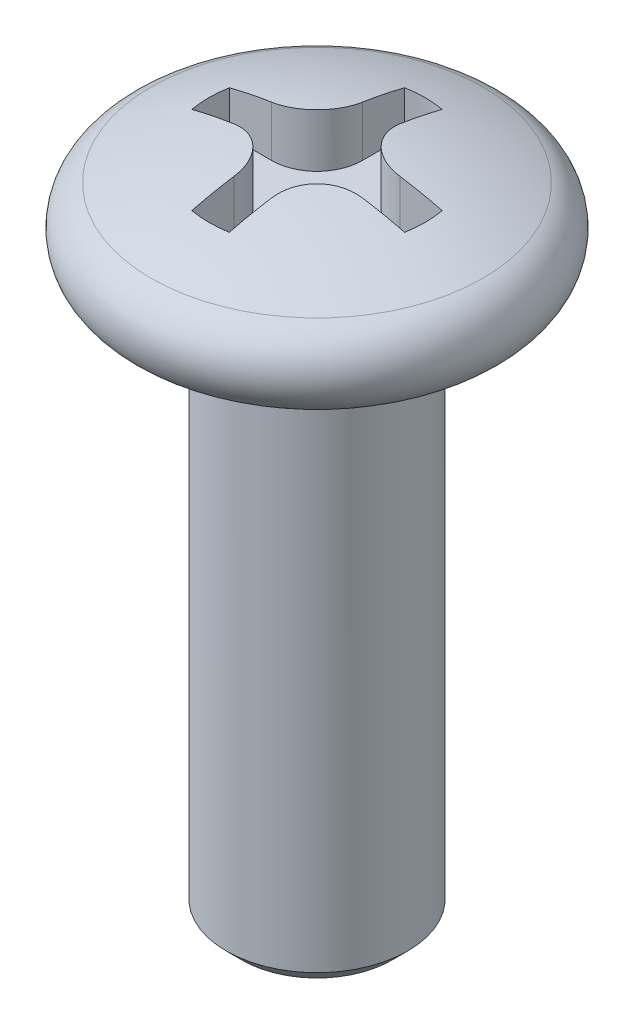
ISO-10303-21;
HEADER;
FILE_DESCRIPTION(('STEP AP214'),'2;1');
FILE_NAME('part.step','',(''),(''),'','','');
FILE_SCHEMA(('AUTOMOTIVE_DESIGN { 1 0 10303 214 1 1 1 1 }'));
ENDSEC;
DATA;
#1=APPLICATION_CONTEXT('core data for automotive mechanical design processes');
#2=APPLICATION_PROTOCOL_DEFINITION('international standard','automotive_design',2000,#1);
#3=PRODUCT_CONTEXT('',#1,'mechanical');
#4=PRODUCT('Part','Part','',(#3));
#5=PRODUCT_RELATED_PRODUCT_CATEGORY('part','',(#4));
#6=PRODUCT_DEFINITION_FORMATION('','',#4);
#7=PRODUCT_DEFINITION_CONTEXT('part definition',#1,'design');
#8=PRODUCT_DEFINITION('design','',#6,#7);
#9=PRODUCT_DEFINITION_SHAPE('','',#8);
#10=(LENGTH_UNIT() NAMED_UNIT(*) SI_UNIT(.MILLI.,.METRE.));
#11=(NAMED_UNIT(*) PLANE_ANGLE_UNIT() SI_UNIT($,.RADIAN.));
#12=(NAMED_UNIT(*) SI_UNIT($,.STERADIAN.) SOLID_ANGLE_UNIT());
#13=UNCERTAINTY_MEASURE_WITH_UNIT(LENGTH_MEASURE(1.E-05),#10,'distance_accuracy_value','');
#14=(GEOMETRIC_REPRESENTATION_CONTEXT(3) GLOBAL_UNCERTAINTY_ASSIGNED_CONTEXT((#13)) GLOBAL_UNIT_ASSIGNED_CONTEXT((#10,
#11,#12)) REPRESENTATION_CONTEXT('',''));
#15=CARTESIAN_POINT('',(0.,0.,0.));
#16=DIRECTION('',(0.,0.,1.));
#17=DIRECTION('',(1.,0.,0.));
#18=AXIS2_PLACEMENT_3D('',#15,#16,#17);
#19=CARTESIAN_POINT('',(0.,0.8,0.));
#20=DIRECTION('',(0.,-1.,0.));
#21=DIRECTION('',(0.,0.,-1.));
#22=AXIS2_PLACEMENT_3D('',#19,#20,#21);
#23=PLANE('',#22);
#24=DIRECTION('',(0.,0.,1.));
#25=VECTOR('',#24,1.);
#26=CARTESIAN_POINT('',(-0.2692388155425,0.8,1.526437178598));
#27=LINE('',#26,#25);
#28=CARTESIAN_POINT('',(-0.2692388155425,0.8,0.9192388155425));
#29=VERTEX_POINT('',#28);
#30=CARTESIAN_POINT('',(-0.2692388155425,0.8,1.52643717859784));
#31=VERTEX_POINT('',#30);
#32=EDGE_CURVE('E223',#29,#31,#27,.T.);
#33=ORIENTED_EDGE('',*,*,#32,.T.);
#34=CARTESIAN_POINT('',(0.,0.8,0.));
#35=DIRECTION('',(0.,-1.,0.));
#36=DIRECTION('',(0.,0.,-1.));
#37=AXIS2_PLACEMENT_3D('',#34,#35,#36);
#38=CIRCLE('',#37,1.55);
#39=CARTESIAN_POINT('',(0.269238815542473,0.8,1.52643717859769));
#40=VERTEX_POINT('',#39);
#41=EDGE_CURVE('E257',#31,#40,#38,.F.);
#42=ORIENTED_EDGE('',*,*,#41,.T.);
#43=DIRECTION('',(0.,0.,-1.));
#44=VECTOR('',#43,1.);
#45=CARTESIAN_POINT('',(0.2692388155425,0.8,0.9192388155425));
#46=LINE('',#45,#44);
#47=CARTESIAN_POINT('',(0.2692388155425,0.8,0.9192388155425));
#48=VERTEX_POINT('',#47);
#49=EDGE_CURVE('E217',#40,#48,#46,.T.);
#50=ORIENTED_EDGE('',*,*,#49,.T.);
#51=CARTESIAN_POINT('',(0.9192388155425,0.8,0.9192388155425));
#52=DIRECTION('',(0.,-1.,0.));
#53=DIRECTION('',(0.,0.,-1.));
#54=AXIS2_PLACEMENT_3D('',#51,#52,#53);
#55=CIRCLE('',#54,0.65);
#56=CARTESIAN_POINT('',(0.9192388155425,0.8,0.2692388155425));
#57=VERTEX_POINT('',#56);
#58=EDGE_CURVE('E222',#57,#48,#55,.F.);
#59=ORIENTED_EDGE('',*,*,#58,.F.);
#60=DIRECTION('',(1.,0.,0.));
#61=VECTOR('',#60,1.);
#62=CARTESIAN_POINT('',(1.526437178598,0.8,0.2692388155425));
#63=LINE('',#62,#61);
#64=CARTESIAN_POINT('',(1.52643717859784,0.8,0.2692388155425));
#65=VERTEX_POINT('',#64);
#66=EDGE_CURVE('E212',#57,#65,#63,.T.);
#67=ORIENTED_EDGE('',*,*,#66,.T.);
#68=CARTESIAN_POINT('',(0.,0.8,0.));
#69=DIRECTION('',(0.,-1.,0.));
#70=DIRECTION('',(0.,0.,-1.));
#71=AXIS2_PLACEMENT_3D('',#68,#69,#70);
#72=CIRCLE('',#71,1.55);
#73=CARTESIAN_POINT('',(1.52643717859769,0.8,-0.269238815542473));
#74=VERTEX_POINT('',#73);
#75=EDGE_CURVE('E271',#65,#74,#72,.F.);
#76=ORIENTED_EDGE('',*,*,#75,.T.);
#77=DIRECTION('',(-1.,0.,0.));
#78=VECTOR('',#77,1.);
#79=CARTESIAN_POINT('',(0.9192388155425,0.8,-0.2692388155425));
#80=LINE('',#79,#78);
#81=CARTESIAN_POINT('',(0.9192388155425,0.8,-0.2692388155425));
#82=VERTEX_POINT('',#81);
#83=EDGE_CURVE('E180',#74,#82,#80,.T.);
#84=ORIENTED_EDGE('',*,*,#83,.T.);
#85=CARTESIAN_POINT('',(0.9192388155425,0.8,-0.9192388155425));
#86=DIRECTION('',(0.,-1.,0.));
#87=DIRECTION('',(0.,0.,-1.));
#88=AXIS2_PLACEMENT_3D('',#85,#86,#87);
#89=CIRCLE('',#88,0.65);
#90=CARTESIAN_POINT('',(0.2692388155425,0.8,-0.9192388155425));
#91=VERTEX_POINT('',#90);
#92=EDGE_CURVE('E186',#91,#82,#89,.F.);
#93=ORIENTED_EDGE('',*,*,#92,.F.);
#94=DIRECTION('',(0.,0.,-1.));
#95=VECTOR('',#94,1.);
#96=CARTESIAN_POINT('',(0.2692388155425,0.8,-1.526437178598));
#97=LINE('',#96,#95);
#98=CARTESIAN_POINT('',(0.2692388155425,0.8,-1.52643717859784));
#99=VERTEX_POINT('',#98);
#100=EDGE_CURVE('E189',#91,#99,#97,.T.);
#101=ORIENTED_EDGE('',*,*,#100,.T.);
#102=CARTESIAN_POINT('',(0.,0.8,0.));
#103=DIRECTION('',(0.,-1.,0.));
#104=DIRECTION('',(0.,0.,-1.));
#105=AXIS2_PLACEMENT_3D('',#102,#103,#104);
#106=CIRCLE('',#105,1.55);
#107=CARTESIAN_POINT('',(-0.269238815542474,0.8,-1.52643717859769));
#108=VERTEX_POINT('',#107);
#109=EDGE_CURVE('E138',#99,#108,#106,.F.);
#110=ORIENTED_EDGE('',*,*,#109,.T.);
#111=DIRECTION('',(0.,0.,1.));
#112=VECTOR('',#111,1.);
#113=CARTESIAN_POINT('',(-0.2692388155425,0.8,-0.9192388155425));
#114=LINE('',#113,#112);
#115=CARTESIAN_POINT('',(-0.2692388155425,0.8,-0.9192388155425));
#116=VERTEX_POINT('',#115);
#117=EDGE_CURVE('E134',#108,#116,#114,.T.);
#118=ORIENTED_EDGE('',*,*,#117,.T.);
#119=CARTESIAN_POINT('',(-0.9192388155425,0.8,-0.9192388155425));
#120=DIRECTION('',(0.,-1.,0.));
#121=DIRECTION('',(0.,0.,-1.));
#122=AXIS2_PLACEMENT_3D('',#119,#120,#121);
#123=CIRCLE('',#122,0.65);
#124=CARTESIAN_POINT('',(-0.9192388155425,0.8,-0.2692388155425));
#125=VERTEX_POINT('',#124);
#126=EDGE_CURVE('E21',#125,#116,#123,.F.);
#127=ORIENTED_EDGE('',*,*,#126,.F.);
#128=DIRECTION('',(-1.,0.,0.));
#129=VECTOR('',#128,1.);
#130=CARTESIAN_POINT('',(-1.526437178598,0.8,-0.2692388155425));
#131=LINE('',#130,#129);
#132=CARTESIAN_POINT('',(-1.52643717859769,0.8,-0.269238815542473));
#133=VERTEX_POINT('',#132);
#134=EDGE_CURVE('E129',#125,#133,#131,.T.);
#135=ORIENTED_EDGE('',*,*,#134,.T.);
#136=CARTESIAN_POINT('',(0.,0.8,0.));
#137=DIRECTION('',(0.,-1.,0.));
#138=DIRECTION('',(0.,0.,-1.));
#139=AXIS2_PLACEMENT_3D('',#136,#137,#138);
#140=CIRCLE('',#139,1.55);
#141=CARTESIAN_POINT('',(-1.52643717859784,0.8,0.2692388155425));
#142=VERTEX_POINT('',#141);
#143=EDGE_CURVE('E267',#133,#142,#140,.F.);
#144=ORIENTED_EDGE('',*,*,#143,.T.);
#145=DIRECTION('',(1.,0.,0.));
#146=VECTOR('',#145,1.);
#147=CARTESIAN_POINT('',(-0.9192388155425,0.8,0.2692388155425));
#148=LINE('',#147,#146);
#149=CARTESIAN_POINT('',(-0.9192388155425,0.8,0.2692388155425));
#150=VERTEX_POINT('',#149);
#151=EDGE_CURVE('E227',#142,#150,#148,.T.);
#152=ORIENTED_EDGE('',*,*,#151,.T.);
#153=CARTESIAN_POINT('',(-0.9192388155425,0.8,0.9192388155425));
#154=DIRECTION('',(0.,-1.,0.));
#155=DIRECTION('',(0.,0.,-1.));
#156=AXIS2_PLACEMENT_3D('',#153,#154,#155);
#157=CIRCLE('',#156,0.65);
#158=EDGE_CURVE('E238',#29,#150,#157,.F.);
#159=ORIENTED_EDGE('',*,*,#158,.F.);
#160=EDGE_LOOP('',(#33,#42,#50,#59,#67,#76,#84,#93,#101,#110,#118,#127,#135,#144,#152,#159));
#161=FACE_BOUND('',#160,.T.);
#162=ADVANCED_FACE('F18',(#161),#23,.F.);
#163=CARTESIAN_POINT('',(-1.526437178598,0.8,-0.2692388155425));
#164=DIRECTION('',(0.,0.,-1.));
#165=DIRECTION('',(-1.,0.,0.));
#166=AXIS2_PLACEMENT_3D('',#163,#164,#165);
#167=PLANE('',#166);
#168=ORIENTED_EDGE('',*,*,#134,.F.);
#169=DIRECTION('',(0.,-1.,0.));
#170=VECTOR('',#169,1.);
#171=CARTESIAN_POINT('',(-0.9192388155425,0.8,-0.2692388155425));
#172=LINE('',#171,#170);
#173=CARTESIAN_POINT('',(-0.919238815542485,1.5247137721749,-0.269238815542501));
#174=VERTEX_POINT('',#173);
#175=EDGE_CURVE('E149',#174,#125,#172,.T.);
#176=ORIENTED_EDGE('',*,*,#175,.F.);
#177=CARTESIAN_POINT('',(-1.52643717859784,1.40083405534686,-0.269238815542502));
#178=CARTESIAN_POINT('',(-1.42628258533272,1.42660341497324,-0.269238815542501));
#179=CARTESIAN_POINT('',(-1.3256054251122,1.44981140452209,-0.2692388155425));
#180=CARTESIAN_POINT('',(-1.12320597076041,1.49110464346474,-0.2692388155425));
#181=CARTESIAN_POINT('',(-1.02148367662913,1.50918989285854,-0.269238815542501));
#182=CARTESIAN_POINT('',(-0.919238815542471,1.52471377217481,-0.269238815542503));
#183=B_SPLINE_CURVE_WITH_KNOTS('',3,(#177,#178,#179,#180,#181,#182),.UNSPECIFIED.,.F.,.F.,(4,2,
4),(0.,0.309952435577939,0.619904871155877),.UNSPECIFIED.);
#184=CARTESIAN_POINT('',(-1.52643717859777,1.40083405534693,-0.269238815542474));
#185=VERTEX_POINT('',#184);
#186=EDGE_CURVE('E235',#185,#174,#183,.T.);
#187=ORIENTED_EDGE('',*,*,#186,.F.);
#188=DIRECTION('',(0.,-1.,0.));
#189=VECTOR('',#188,1.);
#190=CARTESIAN_POINT('',(-1.5264371785977,0.8,-0.269238815542447));
#191=LINE('',#190,#189);
#192=EDGE_CURVE('E179',#185,#133,#191,.T.);
#193=ORIENTED_EDGE('',*,*,#192,.T.);
#194=EDGE_LOOP('',(#168,#176,#187,#193));
#195=FACE_BOUND('',#194,.T.);
#196=ADVANCED_FACE('F338',(#195),#167,.F.);
#197=CARTESIAN_POINT('',(-0.9192388155425,0.8,-0.9192388155425));
#198=DIRECTION('',(0.,-1.,0.));
#199=DIRECTION('',(0.,0.,-1.));
#200=AXIS2_PLACEMENT_3D('',#197,#198,#199);
#201=CYLINDRICAL_SURFACE('',#200,0.65);
#202=DIRECTION('',(0.,1.,0.));
#203=VECTOR('',#202,1.);
#204=CARTESIAN_POINT('',(-0.2692388155425,0.8,-0.9192388155425));
#205=LINE('',#204,#203);
#206=CARTESIAN_POINT('',(-0.269238815542499,1.5247137721749,-0.9192388155425));
#207=VERTEX_POINT('',#206);
#208=EDGE_CURVE('E143',#116,#207,#205,.T.);
#209=ORIENTED_EDGE('',*,*,#208,.T.);
#210=CARTESIAN_POINT('',(-0.919238815542471,1.52471377217481,-0.269238815542502));
#211=CARTESIAN_POINT('',(-0.883271069284547,1.53017838215662,-0.269206596368221));
#212=CARTESIAN_POINT('',(-0.847230957030022,1.53518398680924,-0.272222835690411));
#213=CARTESIAN_POINT('',(-0.776024482266567,1.54415362187526,-0.284194183766013));
#214=CARTESIAN_POINT('',(-0.740857976412674,1.5481178242021,-0.293148311438722));
#215=CARTESIAN_POINT('',(-0.67237147630745,1.55488625546089,-0.316848960302737));
#216=CARTESIAN_POINT('',(-0.639053304502208,1.55768935656103,-0.331601086387425));
#217=CARTESIAN_POINT('',(-0.575297778798748,1.56204492956572,-0.366496760027211));
#218=CARTESIAN_POINT('',(-0.544859240050173,1.56359791783258,-0.386638076978003));
#219=CARTESIAN_POINT('',(-0.488097063461274,1.56539571440067,-0.431479043245953));
#220=CARTESIAN_POINT('',(-0.46172860298219,1.56565593228317,-0.456121349806758));
#221=CARTESIAN_POINT('',(-0.413435525795813,1.56490196217992,-0.509414647326526));
#222=CARTESIAN_POINT('',(-0.391510799474461,1.56388780563375,-0.538065539375813));
#223=CARTESIAN_POINT('',(-0.352825154531402,1.56062536432746,-0.598376464130783));
#224=CARTESIAN_POINT('',(-0.33603703253758,1.55838376285363,-0.630019440211363));
#225=CARTESIAN_POINT('',(-0.307904881496572,1.55273696196925,-0.69554063304805));
#226=CARTESIAN_POINT('',(-0.296559537832556,1.54933204387991,-0.729418307797173));
#227=CARTESIAN_POINT('',(-0.281799832125994,1.54249219211062,-0.789390970708275));
#228=CARTESIAN_POINT('',(-0.277087023520738,1.53929822937966,-0.815202930682549));
#229=CARTESIAN_POINT('',(-0.270805742102409,1.53238664939424,-0.867099473917435));
#230=CARTESIAN_POINT('',(-0.269232761212042,1.52866979112439,-0.893183612184108));
#231=CARTESIAN_POINT('',(-0.269238815542499,1.5247137721748,-0.919238815542471));
#232=B_SPLINE_CURVE_WITH_KNOTS('',3,(#210,#211,#212,#213,#214,#215,#216,#217,#218,#219,#220,
#221,#222,#223,#224,#225,#226,#227,#228,#229,#230,#231),.UNSPECIFIED.,.F.,.F.,(4,2,2,2,2,2,2,2,
2,2,4),(0.,0.109017930799935,0.218017853725243,0.327123406477721,0.436183869743588,
0.543941180487167,0.651695832846214,0.758869525629321,0.866017319256542,0.945129051904781,
1.02412711619082),.UNSPECIFIED.);
#233=EDGE_CURVE('E341',#174,#207,#232,.T.);
#234=ORIENTED_EDGE('',*,*,#233,.F.);
#235=ORIENTED_EDGE('',*,*,#175,.T.);
#236=ORIENTED_EDGE('',*,*,#126,.T.);
#237=EDGE_LOOP('',(#209,#234,#235,#236));
#238=FACE_BOUND('',#237,.T.);
#239=ADVANCED_FACE('F146',(#238),#201,.T.);
#240=CARTESIAN_POINT('',(-0.2692388155425,0.8,-0.9192388155425));
#241=DIRECTION('',(-1.,0.,0.));
#242=DIRECTION('',(0.,0.,1.));
#243=AXIS2_PLACEMENT_3D('',#240,#241,#242);
#244=PLANE('',#243);
#245=ORIENTED_EDGE('',*,*,#117,.F.);
#246=DIRECTION('',(0.,-1.,0.));
#247=VECTOR('',#246,1.);
#248=CARTESIAN_POINT('',(-0.269238815542447,0.8,-1.5264371785977));
#249=LINE('',#248,#247);
#250=CARTESIAN_POINT('',(-0.269238815542499,1.40083405534695,-1.5264371785976));
#251=VERTEX_POINT('',#250);
#252=EDGE_CURVE('E159',#108,#251,#249,.F.);
#253=ORIENTED_EDGE('',*,*,#252,.T.);
#254=CARTESIAN_POINT('',(-0.269238815542499,-4.530985590341,0.));
#255=DIRECTION('',(-1.,0.,0.));
#256=DIRECTION('',(0.,0.,1.));
#257=AXIS2_PLACEMENT_3D('',#254,#255,#256);
#258=CIRCLE('',#257,6.12507100115372);
#259=EDGE_CURVE('E153',#207,#251,#258,.T.);
#260=ORIENTED_EDGE('',*,*,#259,.F.);
#261=ORIENTED_EDGE('',*,*,#208,.F.);
#262=EDGE_LOOP('',(#245,#253,#260,#261));
#263=FACE_BOUND('',#262,.T.);
#264=ADVANCED_FACE('F151',(#263),#244,.F.);
#265=CARTESIAN_POINT('',(0.,0.8,0.));
#266=DIRECTION('',(0.,-1.,0.));
#267=DIRECTION('',(0.,0.,-1.));
#268=AXIS2_PLACEMENT_3D('',#265,#266,#267);
#269=CYLINDRICAL_SURFACE('',#268,1.55);
#270=ORIENTED_EDGE('',*,*,#109,.F.);
#271=DIRECTION('',(0.,1.,0.));
#272=VECTOR('',#271,1.);
#273=CARTESIAN_POINT('',(0.2692388155425,0.8,-1.526437178598));
#274=LINE('',#273,#272);
#275=CARTESIAN_POINT('',(0.2692388155425,1.40083405534691,-1.52643717859775));
#276=VERTEX_POINT('',#275);
#277=EDGE_CURVE('E187',#99,#276,#274,.T.);
#278=ORIENTED_EDGE('',*,*,#277,.T.);
#279=CARTESIAN_POINT('',(0.,1.400834055347,0.));
#280=DIRECTION('',(0.,-1.,0.));
#281=DIRECTION('',(0.,0.,-1.));
#282=AXIS2_PLACEMENT_3D('',#279,#280,#281);
#283=CIRCLE('',#282,1.55);
#284=EDGE_CURVE('E306',#251,#276,#283,.T.);
#285=ORIENTED_EDGE('',*,*,#284,.F.);
#286=ORIENTED_EDGE('',*,*,#252,.F.);
#287=EDGE_LOOP('',(#270,#278,#285,#286));
#288=FACE_BOUND('',#287,.T.);
#289=ADVANCED_FACE('F330',(#288),#269,.F.);
#290=CARTESIAN_POINT('',(0.2692388155425,0.8,-1.526437178598));
#291=DIRECTION('',(1.,0.,0.));
#292=DIRECTION('',(0.,0.,-1.));
#293=AXIS2_PLACEMENT_3D('',#290,#291,#292);
#294=PLANE('',#293);
#295=ORIENTED_EDGE('',*,*,#100,.F.);
#296=DIRECTION('',(0.,-1.,0.));
#297=VECTOR('',#296,1.);
#298=CARTESIAN_POINT('',(0.2692388155425,0.8,-0.9192388155425));
#299=LINE('',#298,#297);
#300=CARTESIAN_POINT('',(0.2692388155425,1.5247137721749,-0.9192388155425));
#301=VERTEX_POINT('',#300);
#302=EDGE_CURVE('E183',#301,#91,#299,.T.);
#303=ORIENTED_EDGE('',*,*,#302,.F.);
#304=CARTESIAN_POINT('',(0.2692388155425,-4.530985590341,0.));
#305=DIRECTION('',(-1.,0.,0.));
#306=DIRECTION('',(0.,0.,1.));
#307=AXIS2_PLACEMENT_3D('',#304,#305,#306);
#308=CIRCLE('',#307,6.12507100115372);
#309=EDGE_CURVE('E302',#276,#301,#308,.F.);
#310=ORIENTED_EDGE('',*,*,#309,.F.);
#311=ORIENTED_EDGE('',*,*,#277,.F.);
#312=EDGE_LOOP('',(#295,#303,#310,#311));
#313=FACE_BOUND('',#312,.T.);
#314=ADVANCED_FACE('F325',(#313),#294,.F.);
#315=CARTESIAN_POINT('',(0.9192388155425,0.8,-0.9192388155425));
#316=DIRECTION('',(0.,-1.,0.));
#317=DIRECTION('',(0.,0.,-1.));
#318=AXIS2_PLACEMENT_3D('',#315,#316,#317);
#319=CYLINDRICAL_SURFACE('',#318,0.65);
#320=DIRECTION('',(0.,1.,0.));
#321=VECTOR('',#320,1.);
#322=CARTESIAN_POINT('',(0.9192388155425,0.8,-0.2692388155425));
#323=LINE('',#322,#321);
#324=CARTESIAN_POINT('',(0.919238815542485,1.5247137721749,-0.269238815542501));
#325=VERTEX_POINT('',#324);
#326=EDGE_CURVE('E174',#82,#325,#323,.T.);
#327=ORIENTED_EDGE('',*,*,#326,.T.);
#328=CARTESIAN_POINT('',(0.2692388155425,1.5247137721748,-0.919238815542471));
#329=CARTESIAN_POINT('',(0.26920659636822,1.53017838215662,-0.883271069284549));
#330=CARTESIAN_POINT('',(0.27222283569041,1.53518398680924,-0.847230957030025));
#331=CARTESIAN_POINT('',(0.284194183766012,1.54415362187526,-0.776024482266574));
#332=CARTESIAN_POINT('',(0.29314831143872,1.5481178242021,-0.740857976412682));
#333=CARTESIAN_POINT('',(0.316848960302734,1.55488625546089,-0.672371476307461));
#334=CARTESIAN_POINT('',(0.33160108638742,1.55768935656103,-0.63905330450222));
#335=CARTESIAN_POINT('',(0.366496760027202,1.56204492956572,-0.575297778798761));
#336=CARTESIAN_POINT('',(0.386638076977991,1.56359791783258,-0.544859240050187));
#337=CARTESIAN_POINT('',(0.431479043245938,1.56539571440067,-0.488097063461288));
#338=CARTESIAN_POINT('',(0.456121349806743,1.56565593228317,-0.461728602982204));
#339=CARTESIAN_POINT('',(0.509414647326511,1.56490196217992,-0.413435525795826));
#340=CARTESIAN_POINT('',(0.538065539375799,1.56388780563376,-0.391510799474473));
#341=CARTESIAN_POINT('',(0.598376464130768,1.56062536432746,-0.352825154531412));
#342=CARTESIAN_POINT('',(0.630019440211347,1.55838376285363,-0.336037032537589));
#343=CARTESIAN_POINT('',(0.695540633048032,1.55273696196925,-0.307904881496577));
#344=CARTESIAN_POINT('',(0.729418307797154,1.54933204387992,-0.296559537832559));
#345=CARTESIAN_POINT('',(0.789390970708259,1.54249219211062,-0.281799832125995));
#346=CARTESIAN_POINT('',(0.815202930682536,1.53929822937967,-0.277087023520739));
#347=CARTESIAN_POINT('',(0.867099473917428,1.53238664939424,-0.270805742102411));
#348=CARTESIAN_POINT('',(0.893183612184104,1.52866979112439,-0.269232761212043));
#349=CARTESIAN_POINT('',(0.91923881554247,1.52471377217481,-0.269238815542501));
#350=B_SPLINE_CURVE_WITH_KNOTS('',3,(#328,#329,#330,#331,#332,#333,#334,#335,#336,#337,#338,
#339,#340,#341,#342,#343,#344,#345,#346,#347,#348,#349),.UNSPECIFIED.,.F.,.F.,(4,2,2,2,2,2,2,2,
2,2,4),(0.,0.10901793079993,0.218017853725233,0.327123406477707,0.436183869743568,
0.543941180487147,0.651695832846195,0.758869525629303,0.866017319256523,0.945129051904771,
1.02412711619082),.UNSPECIFIED.);
#351=EDGE_CURVE('E296',#301,#325,#350,.T.);
#352=ORIENTED_EDGE('',*,*,#351,.F.);
#353=ORIENTED_EDGE('',*,*,#302,.T.);
#354=ORIENTED_EDGE('',*,*,#92,.T.);
#355=EDGE_LOOP('',(#327,#352,#353,#354));
#356=FACE_BOUND('',#355,.T.);
#357=ADVANCED_FACE('F281',(#356),#319,.T.);
#358=CARTESIAN_POINT('',(0.9192388155425,0.8,-0.2692388155425));
#359=DIRECTION('',(0.,0.,-1.));
#360=DIRECTION('',(-1.,0.,0.));
#361=AXIS2_PLACEMENT_3D('',#358,#359,#360);
#362=PLANE('',#361);
#363=ORIENTED_EDGE('',*,*,#83,.F.);
#364=DIRECTION('',(0.,-1.,0.));
#365=VECTOR('',#364,1.);
#366=CARTESIAN_POINT('',(1.5264371785977,0.8,-0.269238815542447));
#367=LINE('',#366,#365);
#368=CARTESIAN_POINT('',(1.52643717859769,1.400834055347,-0.269238815542473));
#369=VERTEX_POINT('',#368);
#370=EDGE_CURVE('E181',#74,#369,#367,.F.);
#371=ORIENTED_EDGE('',*,*,#370,.T.);
#372=CARTESIAN_POINT('',(0.91923881554247,1.52471377217481,-0.269238815542502));
#373=CARTESIAN_POINT('',(1.02148367662913,1.50918989285854,-0.269238815542501));
#374=CARTESIAN_POINT('',(1.12320597076041,1.49110464346474,-0.2692388155425));
#375=CARTESIAN_POINT('',(1.3256054251122,1.44981140452209,-0.2692388155425));
#376=CARTESIAN_POINT('',(1.42628258533272,1.42660341497324,-0.269238815542501));
#377=CARTESIAN_POINT('',(1.52643717859784,1.40083405534686,-0.269238815542503));
#378=B_SPLINE_CURVE_WITH_KNOTS('',3,(#372,#373,#374,#375,#376,#377),.UNSPECIFIED.,.F.,.F.,(4,2,
4),(0.,0.309952435577939,0.619904871155879),.UNSPECIFIED.);
#379=EDGE_CURVE('E290',#325,#369,#378,.T.);
#380=ORIENTED_EDGE('',*,*,#379,.F.);
#381=ORIENTED_EDGE('',*,*,#326,.F.);
#382=EDGE_LOOP('',(#363,#371,#380,#381));
#383=FACE_BOUND('',#382,.T.);
#384=ADVANCED_FACE('F286',(#383),#362,.F.);
#385=CARTESIAN_POINT('',(0.,0.8,0.));
#386=DIRECTION('',(0.,-1.,0.));
#387=DIRECTION('',(0.,0.,-1.));
#388=AXIS2_PLACEMENT_3D('',#385,#386,#387);
#389=CYLINDRICAL_SURFACE('',#388,1.55);
#390=ORIENTED_EDGE('',*,*,#143,.F.);
#391=ORIENTED_EDGE('',*,*,#192,.F.);
#392=CARTESIAN_POINT('',(0.,1.400834055347,0.));
#393=DIRECTION('',(0.,-1.,0.));
#394=DIRECTION('',(0.,0.,-1.));
#395=AXIS2_PLACEMENT_3D('',#392,#393,#394);
#396=CIRCLE('',#395,1.55);
#397=CARTESIAN_POINT('',(-1.52643717859784,1.400834055347,0.2692388155425));
#398=VERTEX_POINT('',#397);
#399=EDGE_CURVE('E295',#398,#185,#396,.T.);
#400=ORIENTED_EDGE('',*,*,#399,.F.);
#401=DIRECTION('',(0.,1.,0.));
#402=VECTOR('',#401,1.);
#403=CARTESIAN_POINT('',(-1.526437178598,0.8,0.2692388155425));
#404=LINE('',#403,#402);
#405=EDGE_CURVE('E230',#398,#142,#404,.F.);
#406=ORIENTED_EDGE('',*,*,#405,.T.);
#407=EDGE_LOOP('',(#390,#391,#400,#406));
#408=FACE_BOUND('',#407,.T.);
#409=ADVANCED_FACE('F405',(#408),#389,.F.);
#410=CARTESIAN_POINT('',(0.,0.8,0.));
#411=DIRECTION('',(0.,-1.,0.));
#412=DIRECTION('',(0.,0.,-1.));
#413=AXIS2_PLACEMENT_3D('',#410,#411,#412);
#414=CYLINDRICAL_SURFACE('',#413,1.55);
#415=ORIENTED_EDGE('',*,*,#370,.F.);
#416=ORIENTED_EDGE('',*,*,#75,.F.);
#417=DIRECTION('',(0.,1.,0.));
#418=VECTOR('',#417,1.);
#419=CARTESIAN_POINT('',(1.526437178598,0.8,0.2692388155425));
#420=LINE('',#419,#418);
#421=CARTESIAN_POINT('',(1.52643717859795,1.40083405534692,0.269238815542498));
#422=VERTEX_POINT('',#421);
#423=EDGE_CURVE('E216',#65,#422,#420,.T.);
#424=ORIENTED_EDGE('',*,*,#423,.T.);
#425=CARTESIAN_POINT('',(0.,1.400834055347,0.));
#426=DIRECTION('',(0.,-1.,0.));
#427=DIRECTION('',(0.,0.,-1.));
#428=AXIS2_PLACEMENT_3D('',#425,#426,#427);
#429=CIRCLE('',#428,1.55);
#430=EDGE_CURVE('E382',#369,#422,#429,.T.);
#431=ORIENTED_EDGE('',*,*,#430,.F.);
#432=EDGE_LOOP('',(#415,#416,#424,#431));
#433=FACE_BOUND('',#432,.T.);
#434=ADVANCED_FACE('F402',(#433),#414,.F.);
#435=CARTESIAN_POINT('',(1.526437178598,0.8,0.2692388155425));
#436=DIRECTION('',(0.,0.,1.));
#437=DIRECTION('',(1.,0.,0.));
#438=AXIS2_PLACEMENT_3D('',#435,#436,#437);
#439=PLANE('',#438);
#440=ORIENTED_EDGE('',*,*,#66,.F.);
#441=DIRECTION('',(0.,-1.,0.));
#442=VECTOR('',#441,1.);
#443=CARTESIAN_POINT('',(0.9192388155425,0.8,0.2692388155425));
#444=LINE('',#443,#442);
#445=CARTESIAN_POINT('',(0.919238815542485,1.5247137721749,0.269238815542499));
#446=VERTEX_POINT('',#445);
#447=EDGE_CURVE('E261',#446,#57,#444,.T.);
#448=ORIENTED_EDGE('',*,*,#447,.F.);
#449=CARTESIAN_POINT('',(1.5264371785979,1.40083405534685,0.269238815542497));
#450=CARTESIAN_POINT('',(1.42628258533276,1.42660341497323,0.269238815542499));
#451=CARTESIAN_POINT('',(1.32560542511224,1.44981140452209,0.2692388155425));
#452=CARTESIAN_POINT('',(1.12320597076043,1.49110464346474,0.2692388155425));
#453=CARTESIAN_POINT('',(1.02148367662914,1.50918989285854,0.269238815542499));
#454=CARTESIAN_POINT('',(0.91923881554247,1.52471377217481,0.269238815542498));
#455=B_SPLINE_CURVE_WITH_KNOTS('',3,(#449,#450,#451,#452,#453,#454),.UNSPECIFIED.,.F.,.F.,(4,2,
4),(0.,0.309952435577969,0.619904871155937),.UNSPECIFIED.);
#456=EDGE_CURVE('E378',#422,#446,#455,.T.);
#457=ORIENTED_EDGE('',*,*,#456,.F.);
#458=ORIENTED_EDGE('',*,*,#423,.F.);
#459=EDGE_LOOP('',(#440,#448,#457,#458));
#460=FACE_BOUND('',#459,.T.);
#461=ADVANCED_FACE('F397',(#460),#439,.F.);
#462=CARTESIAN_POINT('',(0.9192388155425,0.8,0.9192388155425));
#463=DIRECTION('',(0.,-1.,0.));
#464=DIRECTION('',(0.,0.,-1.));
#465=AXIS2_PLACEMENT_3D('',#462,#463,#464);
#466=CYLINDRICAL_SURFACE('',#465,0.65);
#467=DIRECTION('',(0.,1.,0.));
#468=VECTOR('',#467,1.);
#469=CARTESIAN_POINT('',(0.2692388155425,0.8,0.9192388155425));
#470=LINE('',#469,#468);
#471=CARTESIAN_POINT('',(0.2692388155425,1.5247137721749,0.9192388155425));
#472=VERTEX_POINT('',#471);
#473=EDGE_CURVE('E221',#48,#472,#470,.T.);
#474=ORIENTED_EDGE('',*,*,#473,.T.);
#475=CARTESIAN_POINT('',(0.91923881554247,1.52471377217481,0.269238815542498));
#476=CARTESIAN_POINT('',(0.883271069284547,1.53017838215662,0.269206596368219));
#477=CARTESIAN_POINT('',(0.847230957030021,1.53518398680924,0.27222283569041));
#478=CARTESIAN_POINT('',(0.776024482266567,1.54415362187526,0.284194183766014));
#479=CARTESIAN_POINT('',(0.740857976412673,1.5481178242021,0.293148311438724));
#480=CARTESIAN_POINT('',(0.67237147630745,1.55488625546089,0.316848960302739));
#481=CARTESIAN_POINT('',(0.639053304502207,1.55768935656103,0.331601086387426));
#482=CARTESIAN_POINT('',(0.575297778798747,1.56204492956572,0.36649676002721));
#483=CARTESIAN_POINT('',(0.544859240050172,1.56359791783258,0.386638076978001));
#484=CARTESIAN_POINT('',(0.488097063461273,1.56539571440067,0.43147904324595));
#485=CARTESIAN_POINT('',(0.461728602982189,1.56565593228317,0.456121349806757));
#486=CARTESIAN_POINT('',(0.413435525795813,1.56490196217992,0.509414647326527));
#487=CARTESIAN_POINT('',(0.39151079947446,1.56388780563376,0.538065539375815));
#488=CARTESIAN_POINT('',(0.352825154531401,1.56062536432746,0.598376464130786));
#489=CARTESIAN_POINT('',(0.336037032537579,1.55838376285363,0.630019440211365));
#490=CARTESIAN_POINT('',(0.307904881496571,1.55273696196925,0.695540633048051));
#491=CARTESIAN_POINT('',(0.296559537832556,1.54933204387991,0.729418307797174));
#492=CARTESIAN_POINT('',(0.281799832125994,1.54249219211062,0.789390970708276));
#493=CARTESIAN_POINT('',(0.277087023520738,1.53929822937966,0.815202930682551));
#494=CARTESIAN_POINT('',(0.270805742102409,1.53238664939424,0.867099473917437));
#495=CARTESIAN_POINT('',(0.269232761212041,1.52866979112439,0.89318361218411));
#496=CARTESIAN_POINT('',(0.2692388155425,1.5247137721748,0.919238815542473));
#497=B_SPLINE_CURVE_WITH_KNOTS('',3,(#475,#476,#477,#478,#479,#480,#481,#482,#483,#484,#485,
#486,#487,#488,#489,#490,#491,#492,#493,#494,#495,#496),.UNSPECIFIED.,.F.,.F.,(4,2,2,2,2,2,2,2,
2,2,4),(0.,0.109017930799935,0.218017853725244,0.327123406477721,0.436183869743587,
0.543941180487167,0.651695832846216,0.758869525629322,0.866017319256542,0.945129051904782,
1.02412711619082),.UNSPECIFIED.);
#498=EDGE_CURVE('E374',#446,#472,#497,.T.);
#499=ORIENTED_EDGE('',*,*,#498,.F.);
#500=ORIENTED_EDGE('',*,*,#447,.T.);
#501=ORIENTED_EDGE('',*,*,#58,.T.);
#502=EDGE_LOOP('',(#474,#499,#500,#501));
#503=FACE_BOUND('',#502,.T.);
#504=ADVANCED_FACE('F360',(#503),#466,.T.);
#505=CARTESIAN_POINT('',(0.2692388155425,0.8,0.9192388155425));
#506=DIRECTION('',(1.,0.,0.));
#507=DIRECTION('',(0.,0.,-1.));
#508=AXIS2_PLACEMENT_3D('',#505,#506,#507);
#509=PLANE('',#508);
#510=ORIENTED_EDGE('',*,*,#49,.F.);
#511=DIRECTION('',(0.,-1.,0.));
#512=VECTOR('',#511,1.);
#513=CARTESIAN_POINT('',(0.269238815542447,0.8,1.5264371785977));
#514=LINE('',#513,#512);
#515=CARTESIAN_POINT('',(0.2692388155425,1.40083405534695,1.5264371785976));
#516=VERTEX_POINT('',#515);
#517=EDGE_CURVE('E255',#40,#516,#514,.F.);
#518=ORIENTED_EDGE('',*,*,#517,.T.);
#519=CARTESIAN_POINT('',(0.2692388155425,-4.530985590341,0.));
#520=DIRECTION('',(-1.,0.,0.));
#521=DIRECTION('',(0.,0.,1.));
#522=AXIS2_PLACEMENT_3D('',#519,#520,#521);
#523=CIRCLE('',#522,6.12507100115372);
#524=EDGE_CURVE('E368',#472,#516,#523,.F.);
#525=ORIENTED_EDGE('',*,*,#524,.F.);
#526=ORIENTED_EDGE('',*,*,#473,.F.);
#527=EDGE_LOOP('',(#510,#518,#525,#526));
#528=FACE_BOUND('',#527,.T.);
#529=ADVANCED_FACE('F365',(#528),#509,.F.);
#530=CARTESIAN_POINT('',(0.,0.8,0.));
#531=DIRECTION('',(0.,-1.,0.));
#532=DIRECTION('',(0.,0.,-1.));
#533=AXIS2_PLACEMENT_3D('',#530,#531,#532);
#534=CYLINDRICAL_SURFACE('',#533,1.55);
#535=ORIENTED_EDGE('',*,*,#41,.F.);
#536=DIRECTION('',(0.,1.,0.));
#537=VECTOR('',#536,1.);
#538=CARTESIAN_POINT('',(-0.2692388155425,0.8,1.526437178598));
#539=LINE('',#538,#537);
#540=CARTESIAN_POINT('',(-0.269238815542499,1.40083405534691,1.52643717859775));
#541=VERTEX_POINT('',#540);
#542=EDGE_CURVE('E252',#31,#541,#539,.T.);
#543=ORIENTED_EDGE('',*,*,#542,.T.);
#544=CARTESIAN_POINT('',(0.,1.400834055347,0.));
#545=DIRECTION('',(0.,-1.,0.));
#546=DIRECTION('',(0.,0.,-1.));
#547=AXIS2_PLACEMENT_3D('',#544,#545,#546);
#548=CIRCLE('',#547,1.55);
#549=EDGE_CURVE('E373',#516,#541,#548,.T.);
#550=ORIENTED_EDGE('',*,*,#549,.F.);
#551=ORIENTED_EDGE('',*,*,#517,.F.);
#552=EDGE_LOOP('',(#535,#543,#550,#551));
#553=FACE_BOUND('',#552,.T.);
#554=ADVANCED_FACE('F480',(#553),#534,.F.);
#555=CARTESIAN_POINT('',(-0.2692388155425,0.8,1.526437178598));
#556=DIRECTION('',(-1.,0.,0.));
#557=DIRECTION('',(0.,0.,1.));
#558=AXIS2_PLACEMENT_3D('',#555,#556,#557);
#559=PLANE('',#558);
#560=ORIENTED_EDGE('',*,*,#32,.F.);
#561=DIRECTION('',(0.,-1.,0.));
#562=VECTOR('',#561,1.);
#563=CARTESIAN_POINT('',(-0.2692388155425,0.8,0.9192388155425));
#564=LINE('',#563,#562);
#565=CARTESIAN_POINT('',(-0.269238815542499,1.5247137721749,0.9192388155425));
#566=VERTEX_POINT('',#565);
#567=EDGE_CURVE('E244',#566,#29,#564,.T.);
#568=ORIENTED_EDGE('',*,*,#567,.F.);
#569=CARTESIAN_POINT('',(-0.269238815542499,-4.530985590341,0.));
#570=DIRECTION('',(-1.,0.,0.));
#571=DIRECTION('',(0.,0.,1.));
#572=AXIS2_PLACEMENT_3D('',#569,#570,#571);
#573=CIRCLE('',#572,6.12507100115372);
#574=EDGE_CURVE('E491',#541,#566,#573,.T.);
#575=ORIENTED_EDGE('',*,*,#574,.F.);
#576=ORIENTED_EDGE('',*,*,#542,.F.);
#577=EDGE_LOOP('',(#560,#568,#575,#576));
#578=FACE_BOUND('',#577,.T.);
#579=ADVANCED_FACE('F478',(#578),#559,.F.);
#580=CARTESIAN_POINT('',(-0.9192388155425,0.8,0.9192388155425));
#581=DIRECTION('',(0.,-1.,0.));
#582=DIRECTION('',(0.,0.,-1.));
#583=AXIS2_PLACEMENT_3D('',#580,#581,#582);
#584=CYLINDRICAL_SURFACE('',#583,0.65);
#585=DIRECTION('',(0.,1.,0.));
#586=VECTOR('',#585,1.);
#587=CARTESIAN_POINT('',(-0.9192388155425,0.8,0.2692388155425));
#588=LINE('',#587,#586);
#589=CARTESIAN_POINT('',(-0.919238815542485,1.5247137721749,0.269238815542499));
#590=VERTEX_POINT('',#589);
#591=EDGE_CURVE('E37',#150,#590,#588,.T.);
#592=ORIENTED_EDGE('',*,*,#591,.T.);
#593=CARTESIAN_POINT('',(-0.269238815542499,1.5247137721748,0.919238815542473));
#594=CARTESIAN_POINT('',(-0.26920659636822,1.53017838215662,0.883271069284551));
#595=CARTESIAN_POINT('',(-0.27222283569041,1.53518398680924,0.847230957030028));
#596=CARTESIAN_POINT('',(-0.284194183766012,1.54415362187526,0.776024482266576));
#597=CARTESIAN_POINT('',(-0.29314831143872,1.5481178242021,0.740857976412684));
#598=CARTESIAN_POINT('',(-0.316848960302733,1.55488625546089,0.672371476307463));
#599=CARTESIAN_POINT('',(-0.331601086387419,1.55768935656103,0.639053304502222));
#600=CARTESIAN_POINT('',(-0.3664967600272,1.56204492956572,0.575297778798763));
#601=CARTESIAN_POINT('',(-0.386638076977989,1.56359791783258,0.544859240050189));
#602=CARTESIAN_POINT('',(-0.431479043245935,1.56539571440067,0.488097063461289));
#603=CARTESIAN_POINT('',(-0.45612134980674,1.56565593228317,0.461728602982205));
#604=CARTESIAN_POINT('',(-0.509414647326509,1.56490196217992,0.413435525795828));
#605=CARTESIAN_POINT('',(-0.538065539375797,1.56388780563376,0.391510799474476));
#606=CARTESIAN_POINT('',(-0.598376464130766,1.56062536432746,0.352825154531415));
#607=CARTESIAN_POINT('',(-0.630019440211344,1.55838376285363,0.33603703253759));
#608=CARTESIAN_POINT('',(-0.695540633048029,1.55273696196925,0.307904881496579));
#609=CARTESIAN_POINT('',(-0.729418307797152,1.54933204387992,0.296559537832563));
#610=CARTESIAN_POINT('',(-0.789390970708258,1.54249219211062,0.281799832125998));
#611=CARTESIAN_POINT('',(-0.815202930682535,1.53929822937967,0.27708702352074));
#612=CARTESIAN_POINT('',(-0.867099473917428,1.53238664939424,0.270805742102409));
#613=CARTESIAN_POINT('',(-0.893183612184104,1.52866979112439,0.269232761212041));
#614=CARTESIAN_POINT('',(-0.919238815542471,1.52471377217481,0.269238815542499));
#615=B_SPLINE_CURVE_WITH_KNOTS('',3,(#593,#594,#595,#596,#597,#598,#599,#600,#601,#602,#603,
#604,#605,#606,#607,#608,#609,#610,#611,#612,#613,#614),.UNSPECIFIED.,.F.,.F.,(4,2,2,2,2,2,2,2,
2,2,4),(0.,0.10901793079993,0.218017853725234,0.327123406477707,0.436183869743568,
0.543941180487147,0.651695832846194,0.758869525629302,0.866017319256523,0.945129051904773,
1.02412711619082),.UNSPECIFIED.);
#616=EDGE_CURVE('E457',#566,#590,#615,.T.);
#617=ORIENTED_EDGE('',*,*,#616,.F.);
#618=ORIENTED_EDGE('',*,*,#567,.T.);
#619=ORIENTED_EDGE('',*,*,#158,.T.);
#620=EDGE_LOOP('',(#592,#617,#618,#619));
#621=FACE_BOUND('',#620,.T.);
#622=ADVANCED_FACE('F473',(#621),#584,.T.);
#623=CARTESIAN_POINT('',(-0.9192388155425,0.8,0.2692388155425));
#624=DIRECTION('',(0.,0.,1.));
#625=DIRECTION('',(1.,0.,0.));
#626=AXIS2_PLACEMENT_3D('',#623,#624,#625);
#627=PLANE('',#626);
#628=ORIENTED_EDGE('',*,*,#151,.F.);
#629=ORIENTED_EDGE('',*,*,#405,.F.);
#630=CARTESIAN_POINT('',(-0.919238815542471,1.52471377217481,0.269238815542498));
#631=CARTESIAN_POINT('',(-1.02148367662914,1.50918989285854,0.2692388155425));
#632=CARTESIAN_POINT('',(-1.12320597076043,1.49110464346474,0.2692388155425));
#633=CARTESIAN_POINT('',(-1.32560542511224,1.44981140452209,0.2692388155425));
#634=CARTESIAN_POINT('',(-1.42628258533276,1.42660341497323,0.269238815542498));
#635=CARTESIAN_POINT('',(-1.5264371785979,1.40083405534685,0.269238815542496));
#636=B_SPLINE_CURVE_WITH_KNOTS('',3,(#630,#631,#632,#633,#634,#635),.UNSPECIFIED.,.F.,.F.,(4,2,
4),(0.,0.309952435577968,0.619904871155936),.UNSPECIFIED.);
#637=EDGE_CURVE('E451',#590,#398,#636,.T.);
#638=ORIENTED_EDGE('',*,*,#637,.F.);
#639=ORIENTED_EDGE('',*,*,#591,.F.);
#640=EDGE_LOOP('',(#628,#629,#638,#639));
#641=FACE_BOUND('',#640,.T.);
#642=ADVANCED_FACE('F441',(#641),#627,.F.);
#643=CARTESIAN_POINT('',(0.,-4.530985590341,0.));
#644=DIRECTION('',(-1.,0.,0.));
#645=DIRECTION('',(0.,0.,-1.));
#646=AXIS2_PLACEMENT_3D('',#643,#644,#645);
#647=SPHERICAL_SURFACE('',#646,6.130985590341);
#648=CARTESIAN_POINT('',(0.,1.12000000000007,0.));
#649=DIRECTION('',(0.,-1.,0.));
#650=DIRECTION('',(-1.,0.,0.));
#651=AXIS2_PLACEMENT_3D('',#648,#649,#650);
#652=CIRCLE('',#651,2.37809717352503);
#653=CARTESIAN_POINT('',(-2.37809717352503,1.12000000000007,0.));
#654=VERTEX_POINT('',#653);
#655=EDGE_CURVE('E449',#654,#654,#652,.T.);
#656=ORIENTED_EDGE('',*,*,#655,.F.);
#657=EDGE_LOOP('',(#656));
#658=FACE_BOUND('',#657,.T.);
#659=ORIENTED_EDGE('',*,*,#616,.T.);
#660=ORIENTED_EDGE('',*,*,#637,.T.);
#661=ORIENTED_EDGE('',*,*,#399,.T.);
#662=ORIENTED_EDGE('',*,*,#186,.T.);
#663=ORIENTED_EDGE('',*,*,#233,.T.);
#664=ORIENTED_EDGE('',*,*,#259,.T.);
#665=ORIENTED_EDGE('',*,*,#284,.T.);
#666=ORIENTED_EDGE('',*,*,#309,.T.);
#667=ORIENTED_EDGE('',*,*,#351,.T.);
#668=ORIENTED_EDGE('',*,*,#379,.T.);
#669=ORIENTED_EDGE('',*,*,#430,.T.);
#670=ORIENTED_EDGE('',*,*,#456,.T.);
#671=ORIENTED_EDGE('',*,*,#498,.T.);
#672=ORIENTED_EDGE('',*,*,#524,.T.);
#673=ORIENTED_EDGE('',*,*,#549,.T.);
#674=ORIENTED_EDGE('',*,*,#574,.T.);
#675=EDGE_LOOP('',(#659,#660,#661,#662,#663,#664,#665,#666,#667,#668,#669,#670,#671,#672,#673,#674));
#676=FACE_BOUND('',#675,.T.);
#677=ADVANCED_FACE('F300',(#658,#676),#647,.T.);
#678=CARTESIAN_POINT('',(0.,0.56,0.));
#679=DIRECTION('',(0.,-1.,0.));
#680=DIRECTION('',(-1.,0.,0.));
#681=AXIS2_PLACEMENT_3D('',#678,#679,#680);
#682=TOROIDAL_SURFACE('',#681,2.142433076372,0.6075669236282);
#683=CARTESIAN_POINT('',(0.,0.,0.));
#684=DIRECTION('',(0.,-1.,0.));
#685=DIRECTION('',(0.,0.,-1.));
#686=AXIS2_PLACEMENT_3D('',#683,#684,#685);
#687=CIRCLE('',#686,2.3780971735252);
#688=CARTESIAN_POINT('',(0.,0.,-2.3780971735252));
#689=VERTEX_POINT('',#688);
#690=EDGE_CURVE('E446',#689,#689,#687,.T.);
#691=ORIENTED_EDGE('',*,*,#690,.F.);
#692=EDGE_LOOP('',(#691));
#693=FACE_BOUND('',#692,.T.);
#694=ORIENTED_EDGE('',*,*,#655,.T.);
#695=EDGE_LOOP('',(#694));
#696=FACE_BOUND('',#695,.T.);
#697=ADVANCED_FACE('F431',(#693,#696),#682,.T.);
#698=CARTESIAN_POINT('',(0.,-8.,0.));
#699=DIRECTION('',(0.,-1.,0.));
#700=DIRECTION('',(0.,0.,-1.));
#701=AXIS2_PLACEMENT_3D('',#698,#699,#700);
#702=PLANE('',#701);
#703=CARTESIAN_POINT('',(0.,-7.99999999998136,0.));
#704=DIRECTION('',(0.,1.,0.));
#705=DIRECTION('',(0.,0.,1.));
#706=AXIS2_PLACEMENT_3D('',#703,#704,#705);
#707=CIRCLE('',#706,1.07500000001437);
#708=CARTESIAN_POINT('',(0.,-7.99999999998136,1.07500000001437));
#709=VERTEX_POINT('',#708);
#710=EDGE_CURVE('E455',#709,#709,#707,.T.);
#711=ORIENTED_EDGE('',*,*,#710,.F.);
#712=EDGE_LOOP('',(#711));
#713=FACE_BOUND('',#712,.T.);
#714=ADVANCED_FACE('F428',(#713),#702,.T.);
#715=CARTESIAN_POINT('',(0.,0.,0.));
#716=DIRECTION('',(0.,-1.,0.));
#717=DIRECTION('',(0.,0.,-1.));
#718=AXIS2_PLACEMENT_3D('',#715,#716,#717);
#719=PLANE('',#718);
#720=CARTESIAN_POINT('',(0.,0.,0.));
#721=DIRECTION('',(0.,-1.,0.));
#722=DIRECTION('',(0.,0.,-1.));
#723=AXIS2_PLACEMENT_3D('',#720,#721,#722);
#724=CIRCLE('',#723,1.3);
#725=CARTESIAN_POINT('',(0.,0.,-1.3));
#726=VERTEX_POINT('',#725);
#727=EDGE_CURVE('E28',#726,#726,#724,.T.);
#728=ORIENTED_EDGE('',*,*,#727,.F.);
#729=EDGE_LOOP('',(#728));
#730=FACE_BOUND('',#729,.T.);
#731=ORIENTED_EDGE('',*,*,#690,.T.);
#732=EDGE_LOOP('',(#731));
#733=FACE_BOUND('',#732,.T.);
#734=ADVANCED_FACE('F420',(#730,#733),#719,.T.);
#735=CARTESIAN_POINT('',(0.,-7.77499999998099,0.));
#736=DIRECTION('',(0.,1.,0.));
#737=DIRECTION('',(0.,0.,1.));
#738=AXIS2_PLACEMENT_3D('',#735,#736,#737);
#739=CONICAL_SURFACE('',#738,1.30000000001473,0.785398163397448);
#740=CARTESIAN_POINT('',(0.,-7.775,0.));
#741=DIRECTION('',(0.,-1.,0.));
#742=DIRECTION('',(0.,0.,-1.));
#743=AXIS2_PLACEMENT_3D('',#740,#741,#742);
#744=CIRCLE('',#743,1.3);
#745=CARTESIAN_POINT('',(0.,-7.775,-1.3));
#746=VERTEX_POINT('',#745);
#747=EDGE_CURVE('E11',#746,#746,#744,.F.);
#748=ORIENTED_EDGE('',*,*,#747,.F.);
#749=EDGE_LOOP('',(#748));
#750=FACE_BOUND('',#749,.T.);
#751=ORIENTED_EDGE('',*,*,#710,.T.);
#752=EDGE_LOOP('',(#751));
#753=FACE_BOUND('',#752,.T.);
#754=ADVANCED_FACE('F414',(#750,#753),#739,.T.);
#755=CARTESIAN_POINT('',(0.,2.08,0.));
#756=DIRECTION('',(0.,-1.,0.));
#757=DIRECTION('',(0.,0.,-1.));
#758=AXIS2_PLACEMENT_3D('',#755,#756,#757);
#759=CYLINDRICAL_SURFACE('',#758,1.3);
#760=ORIENTED_EDGE('',*,*,#727,.T.);
#761=EDGE_LOOP('',(#760));
#762=FACE_BOUND('',#761,.T.);
#763=ORIENTED_EDGE('',*,*,#747,.T.);
#764=EDGE_LOOP('',(#763));
#765=FACE_BOUND('',#764,.T.);
#766=ADVANCED_FACE('F412',(#762,#765),#759,.T.);
#767=CLOSED_SHELL('',(#162,#196,#239,#264,#289,#314,#357,#384,#409,#434,#461,#504,#529,#554,
#579,#622,#642,#677,#697,#714,#734,#754,#766));
#768=MANIFOLD_SOLID_BREP('B1',#767);
#769=ADVANCED_BREP_SHAPE_REPRESENTATION('',(#18,#768),#14);
#770=SHAPE_DEFINITION_REPRESENTATION(#9,#769);
ENDSEC;
END-ISO-10303-21;
